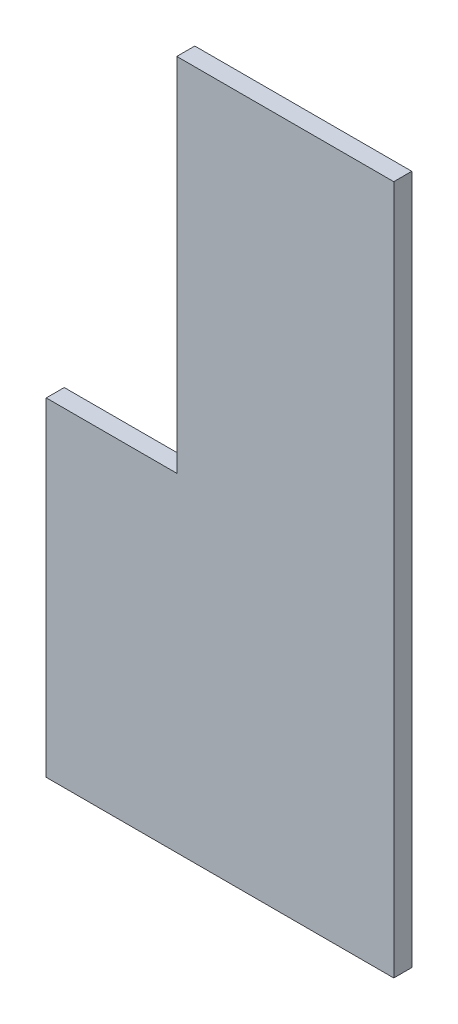
ISO-10303-21;
HEADER;
FILE_DESCRIPTION(('STEP AP214'),'2;1');
FILE_NAME('part.step','',(''),(''),'','','');
FILE_SCHEMA(('AUTOMOTIVE_DESIGN { 1 0 10303 214 1 1 1 1 }'));
ENDSEC;
DATA;
#1=APPLICATION_CONTEXT('core data for automotive mechanical design processes');
#2=APPLICATION_PROTOCOL_DEFINITION('international standard','automotive_design',2000,#1);
#3=PRODUCT_CONTEXT('',#1,'mechanical');
#4=PRODUCT('Part','Part','',(#3));
#5=PRODUCT_RELATED_PRODUCT_CATEGORY('part','',(#4));
#6=PRODUCT_DEFINITION_FORMATION('','',#4);
#7=PRODUCT_DEFINITION_CONTEXT('part definition',#1,'design');
#8=PRODUCT_DEFINITION('design','',#6,#7);
#9=PRODUCT_DEFINITION_SHAPE('','',#8);
#10=(LENGTH_UNIT() NAMED_UNIT(*) SI_UNIT(.MILLI.,.METRE.));
#11=(NAMED_UNIT(*) PLANE_ANGLE_UNIT() SI_UNIT($,.RADIAN.));
#12=(NAMED_UNIT(*) SI_UNIT($,.STERADIAN.) SOLID_ANGLE_UNIT());
#13=UNCERTAINTY_MEASURE_WITH_UNIT(LENGTH_MEASURE(1.E-05),#10,'distance_accuracy_value','');
#14=(GEOMETRIC_REPRESENTATION_CONTEXT(3) GLOBAL_UNCERTAINTY_ASSIGNED_CONTEXT((#13)) GLOBAL_UNIT_ASSIGNED_CONTEXT((#10,
#11,#12)) REPRESENTATION_CONTEXT('',''));
#15=CARTESIAN_POINT('',(0.,0.,0.));
#16=DIRECTION('',(0.,0.,1.));
#17=DIRECTION('',(1.,0.,0.));
#18=AXIS2_PLACEMENT_3D('',#15,#16,#17);
#19=CARTESIAN_POINT('',(386.,0.,-20.));
#20=DIRECTION('',(0.,-1.,0.));
#21=DIRECTION('',(0.,0.,-1.));
#22=AXIS2_PLACEMENT_3D('',#19,#20,#21);
#23=PLANE('',#22);
#24=DIRECTION('',(1.,0.,0.));
#25=VECTOR('',#24,1.);
#26=CARTESIAN_POINT('',(386.,0.,0.));
#27=LINE('',#26,#25);
#28=CARTESIAN_POINT('',(0.,0.,0.));
#29=VERTEX_POINT('',#28);
#30=CARTESIAN_POINT('',(386.,0.,0.));
#31=VERTEX_POINT('',#30);
#32=EDGE_CURVE('E123',#29,#31,#27,.T.);
#33=ORIENTED_EDGE('',*,*,#32,.F.);
#34=DIRECTION('',(0.,0.,1.));
#35=VECTOR('',#34,1.);
#36=CARTESIAN_POINT('',(0.,0.,-20.));
#37=LINE('',#36,#35);
#38=CARTESIAN_POINT('',(0.,0.,-20.));
#39=VERTEX_POINT('',#38);
#40=EDGE_CURVE('E11',#39,#29,#37,.T.);
#41=ORIENTED_EDGE('',*,*,#40,.F.);
#42=DIRECTION('',(1.,0.,0.));
#43=VECTOR('',#42,1.);
#44=CARTESIAN_POINT('',(386.,0.,-20.));
#45=LINE('',#44,#43);
#46=CARTESIAN_POINT('',(386.,0.,-20.));
#47=VERTEX_POINT('',#46);
#48=EDGE_CURVE('E137',#39,#47,#45,.T.);
#49=ORIENTED_EDGE('',*,*,#48,.T.);
#50=DIRECTION('',(0.,0.,1.));
#51=VECTOR('',#50,1.);
#52=CARTESIAN_POINT('',(386.,0.,-20.));
#53=LINE('',#52,#51);
#54=EDGE_CURVE('E41',#47,#31,#53,.T.);
#55=ORIENTED_EDGE('',*,*,#54,.T.);
#56=EDGE_LOOP('',(#33,#41,#49,#55));
#57=FACE_BOUND('',#56,.T.);
#58=ADVANCED_FACE('F38',(#57),#23,.T.);
#59=CARTESIAN_POINT('',(0.,0.,-20.));
#60=DIRECTION('',(-1.,0.,0.));
#61=DIRECTION('',(0.,0.,1.));
#62=AXIS2_PLACEMENT_3D('',#59,#60,#61);
#63=PLANE('',#62);
#64=DIRECTION('',(0.,-1.,0.));
#65=VECTOR('',#64,1.);
#66=CARTESIAN_POINT('',(0.,0.,0.));
#67=LINE('',#66,#65);
#68=CARTESIAN_POINT('',(0.,365.,0.));
#69=VERTEX_POINT('',#68);
#70=EDGE_CURVE('E135',#69,#29,#67,.T.);
#71=ORIENTED_EDGE('',*,*,#70,.F.);
#72=DIRECTION('',(0.,0.,1.));
#73=VECTOR('',#72,1.);
#74=CARTESIAN_POINT('',(0.,365.,-20.));
#75=LINE('',#74,#73);
#76=CARTESIAN_POINT('',(0.,365.,-20.));
#77=VERTEX_POINT('',#76);
#78=EDGE_CURVE('E47',#77,#69,#75,.T.);
#79=ORIENTED_EDGE('',*,*,#78,.F.);
#80=DIRECTION('',(0.,-1.,0.));
#81=VECTOR('',#80,1.);
#82=CARTESIAN_POINT('',(0.,0.,-20.));
#83=LINE('',#82,#81);
#84=EDGE_CURVE('E113',#77,#39,#83,.T.);
#85=ORIENTED_EDGE('',*,*,#84,.T.);
#86=ORIENTED_EDGE('',*,*,#40,.T.);
#87=EDGE_LOOP('',(#71,#79,#85,#86));
#88=FACE_BOUND('',#87,.T.);
#89=ADVANCED_FACE('F145',(#88),#63,.T.);
#90=CARTESIAN_POINT('',(0.,365.,-20.));
#91=DIRECTION('',(0.,1.,0.));
#92=DIRECTION('',(0.,0.,1.));
#93=AXIS2_PLACEMENT_3D('',#90,#91,#92);
#94=PLANE('',#93);
#95=DIRECTION('',(-1.,0.,0.));
#96=VECTOR('',#95,1.);
#97=CARTESIAN_POINT('',(0.,365.,0.));
#98=LINE('',#97,#96);
#99=CARTESIAN_POINT('',(145.,365.,0.));
#100=VERTEX_POINT('',#99);
#101=EDGE_CURVE('E100',#100,#69,#98,.T.);
#102=ORIENTED_EDGE('',*,*,#101,.F.);
#103=DIRECTION('',(0.,0.,1.));
#104=VECTOR('',#103,1.);
#105=CARTESIAN_POINT('',(145.,365.,-20.));
#106=LINE('',#105,#104);
#107=CARTESIAN_POINT('',(145.,365.,-20.));
#108=VERTEX_POINT('',#107);
#109=EDGE_CURVE('E95',#108,#100,#106,.T.);
#110=ORIENTED_EDGE('',*,*,#109,.F.);
#111=DIRECTION('',(-1.,0.,0.));
#112=VECTOR('',#111,1.);
#113=CARTESIAN_POINT('',(0.,365.,-20.));
#114=LINE('',#113,#112);
#115=EDGE_CURVE('E98',#108,#77,#114,.T.);
#116=ORIENTED_EDGE('',*,*,#115,.T.);
#117=ORIENTED_EDGE('',*,*,#78,.T.);
#118=EDGE_LOOP('',(#102,#110,#116,#117));
#119=FACE_BOUND('',#118,.T.);
#120=ADVANCED_FACE('F97',(#119),#94,.T.);
#121=CARTESIAN_POINT('',(145.,365.,-20.));
#122=DIRECTION('',(-1.,0.,0.));
#123=DIRECTION('',(0.,0.,1.));
#124=AXIS2_PLACEMENT_3D('',#121,#122,#123);
#125=PLANE('',#124);
#126=DIRECTION('',(0.,-1.,0.));
#127=VECTOR('',#126,1.);
#128=CARTESIAN_POINT('',(145.,365.,0.));
#129=LINE('',#128,#127);
#130=CARTESIAN_POINT('',(145.,766.,0.));
#131=VERTEX_POINT('',#130);
#132=EDGE_CURVE('E132',#131,#100,#129,.T.);
#133=ORIENTED_EDGE('',*,*,#132,.F.);
#134=DIRECTION('',(0.,0.,1.));
#135=VECTOR('',#134,1.);
#136=CARTESIAN_POINT('',(145.,766.,-20.));
#137=LINE('',#136,#135);
#138=CARTESIAN_POINT('',(145.,766.,-20.));
#139=VERTEX_POINT('',#138);
#140=EDGE_CURVE('E105',#139,#131,#137,.T.);
#141=ORIENTED_EDGE('',*,*,#140,.F.);
#142=DIRECTION('',(0.,-1.,0.));
#143=VECTOR('',#142,1.);
#144=CARTESIAN_POINT('',(145.,365.,-20.));
#145=LINE('',#144,#143);
#146=EDGE_CURVE('E111',#139,#108,#145,.T.);
#147=ORIENTED_EDGE('',*,*,#146,.T.);
#148=ORIENTED_EDGE('',*,*,#109,.T.);
#149=EDGE_LOOP('',(#133,#141,#147,#148));
#150=FACE_BOUND('',#149,.T.);
#151=ADVANCED_FACE('F115',(#150),#125,.T.);
#152=CARTESIAN_POINT('',(145.,766.,-20.));
#153=DIRECTION('',(0.,1.,0.));
#154=DIRECTION('',(0.,0.,1.));
#155=AXIS2_PLACEMENT_3D('',#152,#153,#154);
#156=PLANE('',#155);
#157=DIRECTION('',(-1.,0.,0.));
#158=VECTOR('',#157,1.);
#159=CARTESIAN_POINT('',(145.,766.,0.));
#160=LINE('',#159,#158);
#161=CARTESIAN_POINT('',(386.,766.,0.));
#162=VERTEX_POINT('',#161);
#163=EDGE_CURVE('E129',#162,#131,#160,.T.);
#164=ORIENTED_EDGE('',*,*,#163,.F.);
#165=DIRECTION('',(0.,0.,1.));
#166=VECTOR('',#165,1.);
#167=CARTESIAN_POINT('',(386.,766.,-20.));
#168=LINE('',#167,#166);
#169=CARTESIAN_POINT('',(386.,766.,-20.));
#170=VERTEX_POINT('',#169);
#171=EDGE_CURVE('E140',#170,#162,#168,.T.);
#172=ORIENTED_EDGE('',*,*,#171,.F.);
#173=DIRECTION('',(-1.,0.,0.));
#174=VECTOR('',#173,1.);
#175=CARTESIAN_POINT('',(145.,766.,-20.));
#176=LINE('',#175,#174);
#177=EDGE_CURVE('E116',#170,#139,#176,.T.);
#178=ORIENTED_EDGE('',*,*,#177,.T.);
#179=ORIENTED_EDGE('',*,*,#140,.T.);
#180=EDGE_LOOP('',(#164,#172,#178,#179));
#181=FACE_BOUND('',#180,.T.);
#182=ADVANCED_FACE('F158',(#181),#156,.T.);
#183=CARTESIAN_POINT('',(386.,766.,-20.));
#184=DIRECTION('',(1.,0.,0.));
#185=DIRECTION('',(0.,1.,0.));
#186=AXIS2_PLACEMENT_3D('',#183,#184,#185);
#187=PLANE('',#186);
#188=DIRECTION('',(0.,1.,0.));
#189=VECTOR('',#188,1.);
#190=CARTESIAN_POINT('',(386.,766.,0.));
#191=LINE('',#190,#189);
#192=EDGE_CURVE('E126',#31,#162,#191,.T.);
#193=ORIENTED_EDGE('',*,*,#192,.F.);
#194=ORIENTED_EDGE('',*,*,#54,.F.);
#195=DIRECTION('',(0.,1.,0.));
#196=VECTOR('',#195,1.);
#197=CARTESIAN_POINT('',(386.,766.,-20.));
#198=LINE('',#197,#196);
#199=EDGE_CURVE('E118',#47,#170,#198,.T.);
#200=ORIENTED_EDGE('',*,*,#199,.T.);
#201=ORIENTED_EDGE('',*,*,#171,.T.);
#202=EDGE_LOOP('',(#193,#194,#200,#201));
#203=FACE_BOUND('',#202,.T.);
#204=ADVANCED_FACE('F142',(#203),#187,.T.);
#205=CARTESIAN_POINT('',(0.,0.,-20.));
#206=DIRECTION('',(0.,0.,-1.));
#207=DIRECTION('',(-1.,0.,0.));
#208=AXIS2_PLACEMENT_3D('',#205,#206,#207);
#209=PLANE('',#208);
#210=ORIENTED_EDGE('',*,*,#48,.F.);
#211=ORIENTED_EDGE('',*,*,#84,.F.);
#212=ORIENTED_EDGE('',*,*,#115,.F.);
#213=ORIENTED_EDGE('',*,*,#146,.F.);
#214=ORIENTED_EDGE('',*,*,#177,.F.);
#215=ORIENTED_EDGE('',*,*,#199,.F.);
#216=EDGE_LOOP('',(#210,#211,#212,#213,#214,#215));
#217=FACE_BOUND('',#216,.T.);
#218=ADVANCED_FACE('F109',(#217),#209,.T.);
#219=CARTESIAN_POINT('',(0.,0.,0.));
#220=DIRECTION('',(0.,0.,-1.));
#221=DIRECTION('',(-1.,0.,0.));
#222=AXIS2_PLACEMENT_3D('',#219,#220,#221);
#223=PLANE('',#222);
#224=ORIENTED_EDGE('',*,*,#32,.T.);
#225=ORIENTED_EDGE('',*,*,#192,.T.);
#226=ORIENTED_EDGE('',*,*,#163,.T.);
#227=ORIENTED_EDGE('',*,*,#132,.T.);
#228=ORIENTED_EDGE('',*,*,#101,.T.);
#229=ORIENTED_EDGE('',*,*,#70,.T.);
#230=EDGE_LOOP('',(#224,#225,#226,#227,#228,#229));
#231=FACE_BOUND('',#230,.T.);
#232=ADVANCED_FACE('F144',(#231),#223,.F.);
#233=CLOSED_SHELL('',(#58,#89,#120,#151,#182,#204,#218,#232));
#234=MANIFOLD_SOLID_BREP('B2',#233);
#235=ADVANCED_BREP_SHAPE_REPRESENTATION('',(#18,#234),#14);
#236=SHAPE_DEFINITION_REPRESENTATION(#9,#235);
ENDSEC;
END-ISO-10303-21;
